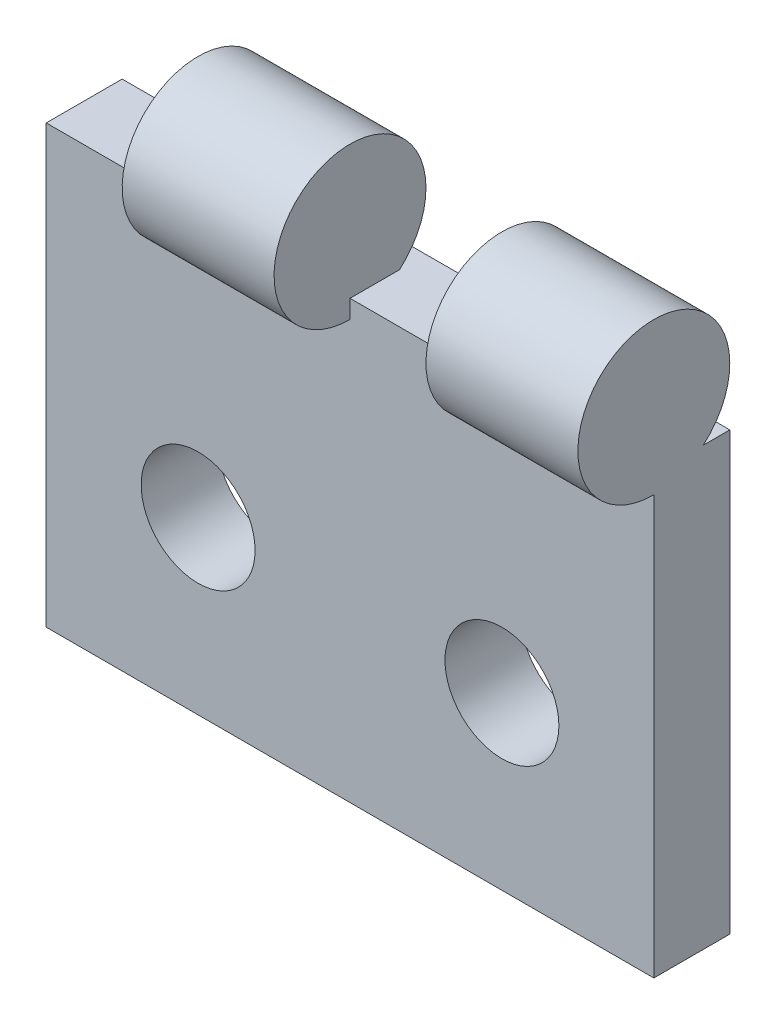
ISO-10303-21;
HEADER;
FILE_DESCRIPTION(('STEP AP214'),'2;1');
FILE_NAME('part.step','',(''),(''),'','','');
FILE_SCHEMA(('AUTOMOTIVE_DESIGN { 1 0 10303 214 1 1 1 1 }'));
ENDSEC;
DATA;
#1=APPLICATION_CONTEXT('core data for automotive mechanical design processes');
#2=APPLICATION_PROTOCOL_DEFINITION('international standard','automotive_design',2000,#1);
#3=PRODUCT_CONTEXT('',#1,'mechanical');
#4=PRODUCT('Part','Part','',(#3));
#5=PRODUCT_RELATED_PRODUCT_CATEGORY('part','',(#4));
#6=PRODUCT_DEFINITION_FORMATION('','',#4);
#7=PRODUCT_DEFINITION_CONTEXT('part definition',#1,'design');
#8=PRODUCT_DEFINITION('design','',#6,#7);
#9=PRODUCT_DEFINITION_SHAPE('','',#8);
#10=(LENGTH_UNIT() NAMED_UNIT(*) SI_UNIT(.MILLI.,.METRE.));
#11=(NAMED_UNIT(*) PLANE_ANGLE_UNIT() SI_UNIT($,.RADIAN.));
#12=(NAMED_UNIT(*) SI_UNIT($,.STERADIAN.) SOLID_ANGLE_UNIT());
#13=UNCERTAINTY_MEASURE_WITH_UNIT(LENGTH_MEASURE(1.E-05),#10,'distance_accuracy_value','');
#14=(GEOMETRIC_REPRESENTATION_CONTEXT(3) GLOBAL_UNCERTAINTY_ASSIGNED_CONTEXT((#13)) GLOBAL_UNIT_ASSIGNED_CONTEXT((#10,
#11,#12)) REPRESENTATION_CONTEXT('',''));
#15=CARTESIAN_POINT('',(0.,0.,0.));
#16=DIRECTION('',(0.,0.,1.));
#17=DIRECTION('',(1.,0.,0.));
#18=AXIS2_PLACEMENT_3D('',#15,#16,#17);
#19=CARTESIAN_POINT('',(0.,11.5,2.));
#20=DIRECTION('',(0.,-1.,0.));
#21=DIRECTION('',(0.,0.,-1.));
#22=AXIS2_PLACEMENT_3D('',#19,#20,#21);
#23=PLANE('',#22);
#24=DIRECTION('',(0.,0.,1.));
#25=VECTOR('',#24,1.);
#26=CARTESIAN_POINT('',(4.,11.5,2.));
#27=LINE('',#26,#25);
#28=CARTESIAN_POINT('',(4.,11.5,0.697745910079163));
#29=VERTEX_POINT('',#28);
#30=CARTESIAN_POINT('',(4.,11.5,2.));
#31=VERTEX_POINT('',#30);
#32=EDGE_CURVE('E116',#29,#31,#27,.T.);
#33=ORIENTED_EDGE('',*,*,#32,.F.);
#34=DIRECTION('',(1.,0.,0.));
#35=VECTOR('',#34,1.);
#36=CARTESIAN_POINT('',(4.,11.5,0.697745910079163));
#37=LINE('',#36,#35);
#38=CARTESIAN_POINT('',(8.,11.5,0.697745910079163));
#39=VERTEX_POINT('',#38);
#40=EDGE_CURVE('E122',#29,#39,#37,.T.);
#41=ORIENTED_EDGE('',*,*,#40,.T.);
#42=DIRECTION('',(0.,0.,1.));
#43=VECTOR('',#42,1.);
#44=CARTESIAN_POINT('',(8.,11.5,2.));
#45=LINE('',#44,#43);
#46=CARTESIAN_POINT('',(8.,11.5,2.));
#47=VERTEX_POINT('',#46);
#48=EDGE_CURVE('E109',#39,#47,#45,.T.);
#49=ORIENTED_EDGE('',*,*,#48,.T.);
#50=DIRECTION('',(-1.,0.,0.));
#51=VECTOR('',#50,1.);
#52=CARTESIAN_POINT('',(0.,11.5,2.));
#53=LINE('',#52,#51);
#54=CARTESIAN_POINT('',(12.,11.5,2.));
#55=VERTEX_POINT('',#54);
#56=EDGE_CURVE('E161',#55,#47,#53,.T.);
#57=ORIENTED_EDGE('',*,*,#56,.F.);
#58=DIRECTION('',(0.,0.,1.));
#59=VECTOR('',#58,1.);
#60=CARTESIAN_POINT('',(12.,11.5,2.));
#61=LINE('',#60,#59);
#62=CARTESIAN_POINT('',(12.,11.5,0.697745910079163));
#63=VERTEX_POINT('',#62);
#64=EDGE_CURVE('E63',#63,#55,#61,.T.);
#65=ORIENTED_EDGE('',*,*,#64,.F.);
#66=DIRECTION('',(1.,0.,0.));
#67=VECTOR('',#66,1.);
#68=CARTESIAN_POINT('',(12.,11.5,0.697745910079163));
#69=LINE('',#68,#67);
#70=CARTESIAN_POINT('',(16.,11.5,0.697745910079163));
#71=VERTEX_POINT('',#70);
#72=EDGE_CURVE('E145',#63,#71,#69,.T.);
#73=ORIENTED_EDGE('',*,*,#72,.T.);
#74=DIRECTION('',(0.,0.,-1.));
#75=VECTOR('',#74,1.);
#76=CARTESIAN_POINT('',(16.,11.5,2.));
#77=LINE('',#76,#75);
#78=CARTESIAN_POINT('',(16.,11.5,0.));
#79=VERTEX_POINT('',#78);
#80=EDGE_CURVE('E180',#71,#79,#77,.T.);
#81=ORIENTED_EDGE('',*,*,#80,.T.);
#82=DIRECTION('',(-1.,0.,0.));
#83=VECTOR('',#82,1.);
#84=CARTESIAN_POINT('',(0.,11.5,0.));
#85=LINE('',#84,#83);
#86=CARTESIAN_POINT('',(0.,11.5,0.));
#87=VERTEX_POINT('',#86);
#88=EDGE_CURVE('E154',#79,#87,#85,.T.);
#89=ORIENTED_EDGE('',*,*,#88,.T.);
#90=DIRECTION('',(0.,0.,-1.));
#91=VECTOR('',#90,1.);
#92=CARTESIAN_POINT('',(0.,11.5,2.));
#93=LINE('',#92,#91);
#94=CARTESIAN_POINT('',(0.,11.5,2.));
#95=VERTEX_POINT('',#94);
#96=EDGE_CURVE('E164',#95,#87,#93,.T.);
#97=ORIENTED_EDGE('',*,*,#96,.F.);
#98=EDGE_CURVE('E160',#31,#95,#53,.T.);
#99=ORIENTED_EDGE('',*,*,#98,.F.);
#100=EDGE_LOOP('',(#33,#41,#49,#57,#65,#73,#81,#89,#97,#99));
#101=FACE_BOUND('',#100,.T.);
#102=ADVANCED_FACE('F39',(#101),#23,.F.);
#103=CARTESIAN_POINT('',(0.,0.,2.));
#104=DIRECTION('',(0.,0.,-1.));
#105=DIRECTION('',(-1.,0.,0.));
#106=AXIS2_PLACEMENT_3D('',#103,#104,#105);
#107=PLANE('',#106);
#108=CARTESIAN_POINT('',(4.,4.5,2.));
#109=DIRECTION('',(0.,0.,1.));
#110=DIRECTION('',(1.,0.,0.));
#111=AXIS2_PLACEMENT_3D('',#108,#109,#110);
#112=CIRCLE('',#111,1.49999999999999);
#113=CARTESIAN_POINT('',(5.49999999999999,4.5,2.));
#114=VERTEX_POINT('',#113);
#115=EDGE_CURVE('E271',#114,#114,#112,.T.);
#116=ORIENTED_EDGE('',*,*,#115,.F.);
#117=EDGE_LOOP('',(#116));
#118=FACE_BOUND('',#117,.T.);
#119=CARTESIAN_POINT('',(12.,4.5,2.));
#120=DIRECTION('',(0.,0.,1.));
#121=DIRECTION('',(1.,0.,0.));
#122=AXIS2_PLACEMENT_3D('',#119,#120,#121);
#123=CIRCLE('',#122,1.49999999999999);
#124=CARTESIAN_POINT('',(13.5,4.5,2.));
#125=VERTEX_POINT('',#124);
#126=EDGE_CURVE('E275',#125,#125,#123,.T.);
#127=ORIENTED_EDGE('',*,*,#126,.F.);
#128=EDGE_LOOP('',(#127));
#129=FACE_BOUND('',#128,.T.);
#130=DIRECTION('',(0.,-1.,0.));
#131=VECTOR('',#130,1.);
#132=CARTESIAN_POINT('',(4.,0.,2.));
#133=LINE('',#132,#131);
#134=CARTESIAN_POINT('',(4.,11.0179375103358,2.));
#135=VERTEX_POINT('',#134);
#136=EDGE_CURVE('E11',#31,#135,#133,.T.);
#137=ORIENTED_EDGE('',*,*,#136,.F.);
#138=ORIENTED_EDGE('',*,*,#98,.T.);
#139=DIRECTION('',(0.,-1.,0.));
#140=VECTOR('',#139,1.);
#141=CARTESIAN_POINT('',(0.,0.,2.));
#142=LINE('',#141,#140);
#143=CARTESIAN_POINT('',(0.,0.,2.));
#144=VERTEX_POINT('',#143);
#145=EDGE_CURVE('E149',#95,#144,#142,.T.);
#146=ORIENTED_EDGE('',*,*,#145,.T.);
#147=DIRECTION('',(1.,0.,0.));
#148=VECTOR('',#147,1.);
#149=CARTESIAN_POINT('',(0.,0.,2.));
#150=LINE('',#149,#148);
#151=CARTESIAN_POINT('',(16.,0.,2.));
#152=VERTEX_POINT('',#151);
#153=EDGE_CURVE('E153',#144,#152,#150,.T.);
#154=ORIENTED_EDGE('',*,*,#153,.T.);
#155=DIRECTION('',(0.,1.,0.));
#156=VECTOR('',#155,1.);
#157=CARTESIAN_POINT('',(16.,0.,2.));
#158=LINE('',#157,#156);
#159=CARTESIAN_POINT('',(16.,11.0179375103358,2.));
#160=VERTEX_POINT('',#159);
#161=EDGE_CURVE('E157',#152,#160,#158,.T.);
#162=ORIENTED_EDGE('',*,*,#161,.T.);
#163=DIRECTION('',(1.,0.,0.));
#164=VECTOR('',#163,1.);
#165=CARTESIAN_POINT('',(12.,11.0179375103358,2.));
#166=LINE('',#165,#164);
#167=CARTESIAN_POINT('',(12.,11.0179375103358,2.));
#168=VERTEX_POINT('',#167);
#169=EDGE_CURVE('E195',#160,#168,#166,.F.);
#170=ORIENTED_EDGE('',*,*,#169,.T.);
#171=DIRECTION('',(0.,-1.,0.));
#172=VECTOR('',#171,1.);
#173=CARTESIAN_POINT('',(12.,0.,2.));
#174=LINE('',#173,#172);
#175=EDGE_CURVE('E191',#55,#168,#174,.T.);
#176=ORIENTED_EDGE('',*,*,#175,.F.);
#177=ORIENTED_EDGE('',*,*,#56,.T.);
#178=DIRECTION('',(0.,-1.,0.));
#179=VECTOR('',#178,1.);
#180=CARTESIAN_POINT('',(8.,0.,2.));
#181=LINE('',#180,#179);
#182=CARTESIAN_POINT('',(8.,11.0179375103358,2.));
#183=VERTEX_POINT('',#182);
#184=EDGE_CURVE('E112',#47,#183,#181,.T.);
#185=ORIENTED_EDGE('',*,*,#184,.T.);
#186=DIRECTION('',(1.,0.,0.));
#187=VECTOR('',#186,1.);
#188=CARTESIAN_POINT('',(4.,11.0179375103358,2.));
#189=LINE('',#188,#187);
#190=EDGE_CURVE('E48',#183,#135,#189,.F.);
#191=ORIENTED_EDGE('',*,*,#190,.T.);
#192=EDGE_LOOP('',(#137,#138,#146,#154,#162,#170,#176,#177,#185,#191));
#193=FACE_BOUND('',#192,.T.);
#194=ADVANCED_FACE('F202',(#118,#129,#193),#107,.F.);
#195=CARTESIAN_POINT('',(0.,0.,2.));
#196=DIRECTION('',(1.,0.,0.));
#197=DIRECTION('',(0.,0.,-1.));
#198=AXIS2_PLACEMENT_3D('',#195,#196,#197);
#199=PLANE('',#198);
#200=DIRECTION('',(0.,-1.,0.));
#201=VECTOR('',#200,1.);
#202=CARTESIAN_POINT('',(0.,0.,0.));
#203=LINE('',#202,#201);
#204=CARTESIAN_POINT('',(0.,0.,0.));
#205=VERTEX_POINT('',#204);
#206=EDGE_CURVE('E148',#87,#205,#203,.T.);
#207=ORIENTED_EDGE('',*,*,#206,.T.);
#208=DIRECTION('',(0.,0.,-1.));
#209=VECTOR('',#208,1.);
#210=CARTESIAN_POINT('',(0.,0.,2.));
#211=LINE('',#210,#209);
#212=EDGE_CURVE('E187',#144,#205,#211,.T.);
#213=ORIENTED_EDGE('',*,*,#212,.F.);
#214=ORIENTED_EDGE('',*,*,#145,.F.);
#215=ORIENTED_EDGE('',*,*,#96,.T.);
#216=EDGE_LOOP('',(#207,#213,#214,#215));
#217=FACE_BOUND('',#216,.T.);
#218=ADVANCED_FACE('F41',(#217),#199,.F.);
#219=CARTESIAN_POINT('',(0.,0.,2.));
#220=DIRECTION('',(0.,1.,0.));
#221=DIRECTION('',(0.,0.,1.));
#222=AXIS2_PLACEMENT_3D('',#219,#220,#221);
#223=PLANE('',#222);
#224=DIRECTION('',(1.,0.,0.));
#225=VECTOR('',#224,1.);
#226=CARTESIAN_POINT('',(0.,0.,0.));
#227=LINE('',#226,#225);
#228=CARTESIAN_POINT('',(16.,0.,0.));
#229=VERTEX_POINT('',#228);
#230=EDGE_CURVE('E168',#205,#229,#227,.T.);
#231=ORIENTED_EDGE('',*,*,#230,.T.);
#232=DIRECTION('',(0.,0.,-1.));
#233=VECTOR('',#232,1.);
#234=CARTESIAN_POINT('',(16.,0.,2.));
#235=LINE('',#234,#233);
#236=EDGE_CURVE('E183',#152,#229,#235,.T.);
#237=ORIENTED_EDGE('',*,*,#236,.F.);
#238=ORIENTED_EDGE('',*,*,#153,.F.);
#239=ORIENTED_EDGE('',*,*,#212,.T.);
#240=EDGE_LOOP('',(#231,#237,#238,#239));
#241=FACE_BOUND('',#240,.T.);
#242=ADVANCED_FACE('F226',(#241),#223,.F.);
#243=CARTESIAN_POINT('',(16.,0.,2.));
#244=DIRECTION('',(-1.,0.,0.));
#245=DIRECTION('',(0.,0.,1.));
#246=AXIS2_PLACEMENT_3D('',#243,#244,#245);
#247=PLANE('',#246);
#248=ORIENTED_EDGE('',*,*,#80,.F.);
#249=CARTESIAN_POINT('',(16.,13.0179375103358,2.));
#250=DIRECTION('',(1.,0.,0.));
#251=DIRECTION('',(0.,0.,-1.));
#252=AXIS2_PLACEMENT_3D('',#249,#250,#251);
#253=CIRCLE('',#252,2.);
#254=EDGE_CURVE('E131',#71,#160,#253,.T.);
#255=ORIENTED_EDGE('',*,*,#254,.T.);
#256=ORIENTED_EDGE('',*,*,#161,.F.);
#257=ORIENTED_EDGE('',*,*,#236,.T.);
#258=DIRECTION('',(0.,1.,0.));
#259=VECTOR('',#258,1.);
#260=CARTESIAN_POINT('',(16.,0.,0.));
#261=LINE('',#260,#259);
#262=EDGE_CURVE('E171',#229,#79,#261,.T.);
#263=ORIENTED_EDGE('',*,*,#262,.T.);
#264=EDGE_LOOP('',(#248,#255,#256,#257,#263));
#265=FACE_BOUND('',#264,.T.);
#266=ADVANCED_FACE('F212',(#265),#247,.F.);
#267=CARTESIAN_POINT('',(0.,0.,0.));
#268=DIRECTION('',(0.,0.,-1.));
#269=DIRECTION('',(-1.,0.,0.));
#270=AXIS2_PLACEMENT_3D('',#267,#268,#269);
#271=PLANE('',#270);
#272=CARTESIAN_POINT('',(4.,4.5,0.));
#273=DIRECTION('',(0.,0.,1.));
#274=DIRECTION('',(1.,0.,0.));
#275=AXIS2_PLACEMENT_3D('',#272,#273,#274);
#276=CIRCLE('',#275,1.5);
#277=CARTESIAN_POINT('',(5.5,4.5,0.));
#278=VERTEX_POINT('',#277);
#279=EDGE_CURVE('E268',#278,#278,#276,.T.);
#280=ORIENTED_EDGE('',*,*,#279,.T.);
#281=EDGE_LOOP('',(#280));
#282=FACE_BOUND('',#281,.T.);
#283=CARTESIAN_POINT('',(12.,4.5,0.));
#284=DIRECTION('',(0.,0.,1.));
#285=DIRECTION('',(1.,0.,0.));
#286=AXIS2_PLACEMENT_3D('',#283,#284,#285);
#287=CIRCLE('',#286,1.5);
#288=CARTESIAN_POINT('',(13.5,4.5,0.));
#289=VERTEX_POINT('',#288);
#290=EDGE_CURVE('E126',#289,#289,#287,.T.);
#291=ORIENTED_EDGE('',*,*,#290,.T.);
#292=EDGE_LOOP('',(#291));
#293=FACE_BOUND('',#292,.T.);
#294=ORIENTED_EDGE('',*,*,#206,.F.);
#295=ORIENTED_EDGE('',*,*,#88,.F.);
#296=ORIENTED_EDGE('',*,*,#262,.F.);
#297=ORIENTED_EDGE('',*,*,#230,.F.);
#298=EDGE_LOOP('',(#294,#295,#296,#297));
#299=FACE_BOUND('',#298,.T.);
#300=ADVANCED_FACE('F219',(#282,#293,#299),#271,.T.);
#301=CARTESIAN_POINT('',(12.,13.0179375103358,2.));
#302=DIRECTION('',(1.,0.,0.));
#303=DIRECTION('',(0.,0.,-1.));
#304=AXIS2_PLACEMENT_3D('',#301,#302,#303);
#305=CYLINDRICAL_SURFACE('',#304,2.);
#306=ORIENTED_EDGE('',*,*,#72,.F.);
#307=CARTESIAN_POINT('',(12.,13.0179375103358,2.));
#308=DIRECTION('',(1.,0.,0.));
#309=DIRECTION('',(0.,0.,-1.));
#310=AXIS2_PLACEMENT_3D('',#307,#308,#309);
#311=CIRCLE('',#310,2.);
#312=EDGE_CURVE('E136',#63,#168,#311,.T.);
#313=ORIENTED_EDGE('',*,*,#312,.T.);
#314=ORIENTED_EDGE('',*,*,#169,.F.);
#315=ORIENTED_EDGE('',*,*,#254,.F.);
#316=EDGE_LOOP('',(#306,#313,#314,#315));
#317=FACE_BOUND('',#316,.T.);
#318=ADVANCED_FACE('F208',(#317),#305,.T.);
#319=CARTESIAN_POINT('',(12.,13.0179375103358,2.));
#320=DIRECTION('',(1.,0.,0.));
#321=DIRECTION('',(0.,0.,-1.));
#322=AXIS2_PLACEMENT_3D('',#319,#320,#321);
#323=PLANE('',#322);
#324=ORIENTED_EDGE('',*,*,#312,.F.);
#325=ORIENTED_EDGE('',*,*,#64,.T.);
#326=ORIENTED_EDGE('',*,*,#175,.T.);
#327=EDGE_LOOP('',(#324,#325,#326));
#328=FACE_BOUND('',#327,.T.);
#329=ADVANCED_FACE('F205',(#328),#323,.F.);
#330=CARTESIAN_POINT('',(4.,13.0179375103358,2.));
#331=DIRECTION('',(1.,0.,0.));
#332=DIRECTION('',(0.,0.,-1.));
#333=AXIS2_PLACEMENT_3D('',#330,#331,#332);
#334=CYLINDRICAL_SURFACE('',#333,2.);
#335=ORIENTED_EDGE('',*,*,#40,.F.);
#336=CARTESIAN_POINT('',(4.,13.0179375103358,2.));
#337=DIRECTION('',(1.,0.,0.));
#338=DIRECTION('',(0.,0.,-1.));
#339=AXIS2_PLACEMENT_3D('',#336,#337,#338);
#340=CIRCLE('',#339,2.);
#341=EDGE_CURVE('E117',#29,#135,#340,.T.);
#342=ORIENTED_EDGE('',*,*,#341,.T.);
#343=ORIENTED_EDGE('',*,*,#190,.F.);
#344=CARTESIAN_POINT('',(8.,13.0179375103358,2.));
#345=DIRECTION('',(1.,0.,0.));
#346=DIRECTION('',(0.,0.,-1.));
#347=AXIS2_PLACEMENT_3D('',#344,#345,#346);
#348=CIRCLE('',#347,2.);
#349=EDGE_CURVE('E55',#39,#183,#348,.T.);
#350=ORIENTED_EDGE('',*,*,#349,.F.);
#351=EDGE_LOOP('',(#335,#342,#343,#350));
#352=FACE_BOUND('',#351,.T.);
#353=ADVANCED_FACE('F120',(#352),#334,.T.);
#354=CARTESIAN_POINT('',(4.,13.0179375103358,2.));
#355=DIRECTION('',(1.,0.,0.));
#356=DIRECTION('',(0.,0.,-1.));
#357=AXIS2_PLACEMENT_3D('',#354,#355,#356);
#358=PLANE('',#357);
#359=ORIENTED_EDGE('',*,*,#341,.F.);
#360=ORIENTED_EDGE('',*,*,#32,.T.);
#361=ORIENTED_EDGE('',*,*,#136,.T.);
#362=EDGE_LOOP('',(#359,#360,#361));
#363=FACE_BOUND('',#362,.T.);
#364=ADVANCED_FACE('F250',(#363),#358,.F.);
#365=CARTESIAN_POINT('',(8.,13.0179375103358,2.));
#366=DIRECTION('',(1.,0.,0.));
#367=DIRECTION('',(0.,0.,-1.));
#368=AXIS2_PLACEMENT_3D('',#365,#366,#367);
#369=PLANE('',#368);
#370=ORIENTED_EDGE('',*,*,#48,.F.);
#371=ORIENTED_EDGE('',*,*,#349,.T.);
#372=ORIENTED_EDGE('',*,*,#184,.F.);
#373=EDGE_LOOP('',(#370,#371,#372));
#374=FACE_BOUND('',#373,.T.);
#375=ADVANCED_FACE('F110',(#374),#369,.T.);
#376=CARTESIAN_POINT('',(12.,4.5,2.));
#377=DIRECTION('',(0.,0.,1.));
#378=DIRECTION('',(1.,0.,0.));
#379=AXIS2_PLACEMENT_3D('',#376,#377,#378);
#380=CYLINDRICAL_SURFACE('',#379,1.49999999999999);
#381=ORIENTED_EDGE('',*,*,#290,.F.);
#382=EDGE_LOOP('',(#381));
#383=FACE_BOUND('',#382,.T.);
#384=ORIENTED_EDGE('',*,*,#126,.T.);
#385=EDGE_LOOP('',(#384));
#386=FACE_BOUND('',#385,.T.);
#387=ADVANCED_FACE('F253',(#383,#386),#380,.F.);
#388=CARTESIAN_POINT('',(4.,4.5,2.));
#389=DIRECTION('',(0.,0.,1.));
#390=DIRECTION('',(1.,0.,0.));
#391=AXIS2_PLACEMENT_3D('',#388,#389,#390);
#392=CYLINDRICAL_SURFACE('',#391,1.49999999999999);
#393=ORIENTED_EDGE('',*,*,#279,.F.);
#394=EDGE_LOOP('',(#393));
#395=FACE_BOUND('',#394,.T.);
#396=ORIENTED_EDGE('',*,*,#115,.T.);
#397=EDGE_LOOP('',(#396));
#398=FACE_BOUND('',#397,.T.);
#399=ADVANCED_FACE('F259',(#395,#398),#392,.F.);
#400=CLOSED_SHELL('',(#102,#194,#218,#242,#266,#300,#318,#329,#353,#364,#375,#387,#399));
#401=MANIFOLD_SOLID_BREP('B2',#400);
#402=ADVANCED_BREP_SHAPE_REPRESENTATION('',(#18,#401),#14);
#403=SHAPE_DEFINITION_REPRESENTATION(#9,#402);
ENDSEC;
END-ISO-10303-21;
